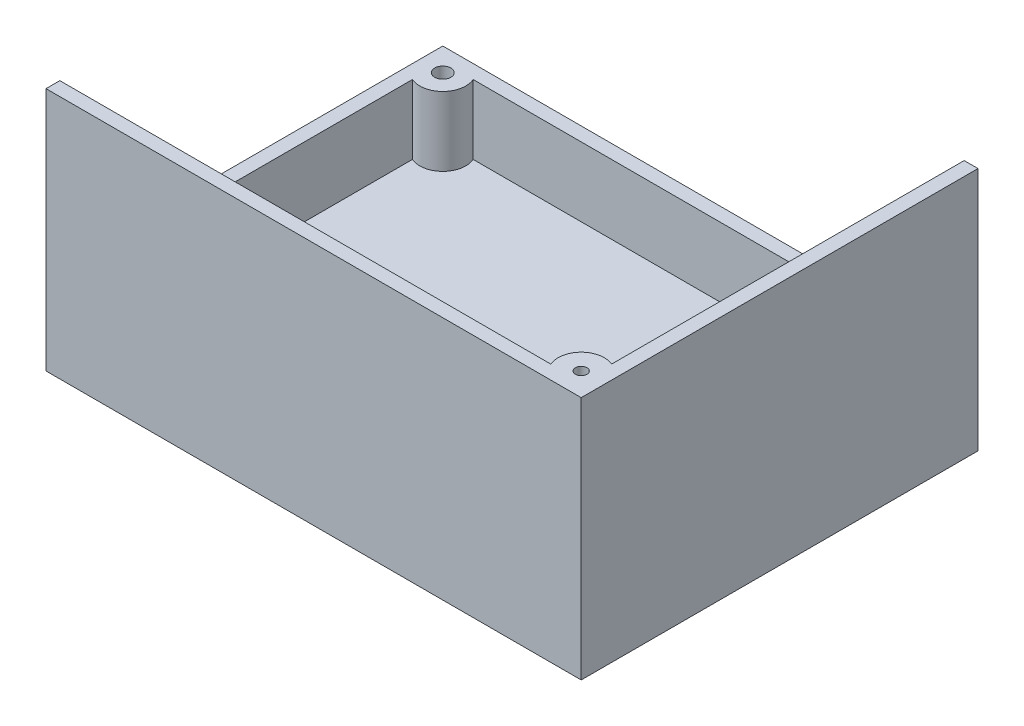
ISO-10303-21;
HEADER;
FILE_DESCRIPTION(('STEP AP214'),'2;1');
FILE_NAME('part.step','',(''),(''),'','','');
FILE_SCHEMA(('AUTOMOTIVE_DESIGN { 1 0 10303 214 1 1 1 1 }'));
ENDSEC;
DATA;
#1=APPLICATION_CONTEXT('core data for automotive mechanical design processes');
#2=APPLICATION_PROTOCOL_DEFINITION('international standard','automotive_design',2000,#1);
#3=PRODUCT_CONTEXT('',#1,'mechanical');
#4=PRODUCT('Part','Part','',(#3));
#5=PRODUCT_RELATED_PRODUCT_CATEGORY('part','',(#4));
#6=PRODUCT_DEFINITION_FORMATION('','',#4);
#7=PRODUCT_DEFINITION_CONTEXT('part definition',#1,'design');
#8=PRODUCT_DEFINITION('design','',#6,#7);
#9=PRODUCT_DEFINITION_SHAPE('','',#8);
#10=(LENGTH_UNIT() NAMED_UNIT(*) SI_UNIT(.MILLI.,.METRE.));
#11=(NAMED_UNIT(*) PLANE_ANGLE_UNIT() SI_UNIT($,.RADIAN.));
#12=(NAMED_UNIT(*) SI_UNIT($,.STERADIAN.) SOLID_ANGLE_UNIT());
#13=UNCERTAINTY_MEASURE_WITH_UNIT(LENGTH_MEASURE(1.E-05),#10,'distance_accuracy_value','');
#14=(GEOMETRIC_REPRESENTATION_CONTEXT(3) GLOBAL_UNCERTAINTY_ASSIGNED_CONTEXT((#13)) GLOBAL_UNIT_ASSIGNED_CONTEXT((#10,
#11,#12)) REPRESENTATION_CONTEXT('',''));
#15=CARTESIAN_POINT('',(0.,0.,0.));
#16=DIRECTION('',(0.,0.,1.));
#17=DIRECTION('',(1.,0.,0.));
#18=AXIS2_PLACEMENT_3D('',#15,#16,#17);
#19=CARTESIAN_POINT('',(0.,53.,0.));
#20=DIRECTION('',(0.,0.,-1.));
#21=DIRECTION('',(-1.,0.,0.));
#22=AXIS2_PLACEMENT_3D('',#19,#20,#21);
#23=PLANE('',#22);
#24=DIRECTION('',(0.,-1.,0.));
#25=VECTOR('',#24,1.);
#26=CARTESIAN_POINT('',(110.,38.,0.));
#27=LINE('',#26,#25);
#28=CARTESIAN_POINT('',(110.,38.,0.));
#29=VERTEX_POINT('',#28);
#30=CARTESIAN_POINT('',(110.,3.,0.));
#31=VERTEX_POINT('',#30);
#32=EDGE_CURVE('E162',#29,#31,#27,.T.);
#33=ORIENTED_EDGE('',*,*,#32,.T.);
#34=DIRECTION('',(1.,0.,0.));
#35=VECTOR('',#34,1.);
#36=CARTESIAN_POINT('',(0.,3.,0.));
#37=LINE('',#36,#35);
#38=CARTESIAN_POINT('',(0.,3.,0.));
#39=VERTEX_POINT('',#38);
#40=EDGE_CURVE('E329',#39,#31,#37,.T.);
#41=ORIENTED_EDGE('',*,*,#40,.F.);
#42=DIRECTION('',(0.,-1.,0.));
#43=VECTOR('',#42,1.);
#44=CARTESIAN_POINT('',(0.,53.,0.));
#45=LINE('',#44,#43);
#46=CARTESIAN_POINT('',(0.,18.,0.));
#47=VERTEX_POINT('',#46);
#48=EDGE_CURVE('E278',#47,#39,#45,.T.);
#49=ORIENTED_EDGE('',*,*,#48,.F.);
#50=DIRECTION('',(-1.,0.,0.));
#51=VECTOR('',#50,1.);
#52=CARTESIAN_POINT('',(110.,18.,0.));
#53=LINE('',#52,#51);
#54=CARTESIAN_POINT('',(-3.,18.,0.));
#55=VERTEX_POINT('',#54);
#56=EDGE_CURVE('E221',#47,#55,#53,.T.);
#57=ORIENTED_EDGE('',*,*,#56,.T.);
#58=DIRECTION('',(0.,1.,0.));
#59=VECTOR('',#58,1.);
#60=CARTESIAN_POINT('',(-3.,53.,0.));
#61=LINE('',#60,#59);
#62=CARTESIAN_POINT('',(-3.,53.,0.));
#63=VERTEX_POINT('',#62);
#64=EDGE_CURVE('E224',#55,#63,#61,.T.);
#65=ORIENTED_EDGE('',*,*,#64,.T.);
#66=DIRECTION('',(1.,0.,0.));
#67=VECTOR('',#66,1.);
#68=CARTESIAN_POINT('',(0.,53.,0.));
#69=LINE('',#68,#67);
#70=CARTESIAN_POINT('',(103.417424305044,53.,0.));
#71=VERTEX_POINT('',#70);
#72=EDGE_CURVE('E269',#63,#71,#69,.T.);
#73=ORIENTED_EDGE('',*,*,#72,.T.);
#74=DIRECTION('',(0.,-1.,0.));
#75=VECTOR('',#74,1.);
#76=CARTESIAN_POINT('',(103.417424305044,53.,0.));
#77=LINE('',#76,#75);
#78=CARTESIAN_POINT('',(103.417424305044,38.,0.));
#79=VERTEX_POINT('',#78);
#80=EDGE_CURVE('E164',#71,#79,#77,.T.);
#81=ORIENTED_EDGE('',*,*,#80,.T.);
#82=DIRECTION('',(1.,0.,0.));
#83=VECTOR('',#82,1.);
#84=CARTESIAN_POINT('',(110.,38.,0.));
#85=LINE('',#84,#83);
#86=EDGE_CURVE('E159',#79,#29,#85,.T.);
#87=ORIENTED_EDGE('',*,*,#86,.T.);
#88=EDGE_LOOP('',(#33,#41,#49,#57,#65,#73,#81,#87));
#89=FACE_BOUND('',#88,.T.);
#90=ADVANCED_FACE('F39',(#89),#23,.T.);
#91=CARTESIAN_POINT('',(110.,53.,0.));
#92=DIRECTION('',(-1.,0.,0.));
#93=DIRECTION('',(0.,0.,1.));
#94=AXIS2_PLACEMENT_3D('',#91,#92,#93);
#95=PLANE('',#94);
#96=DIRECTION('',(0.,-1.,0.));
#97=VECTOR('',#96,1.);
#98=CARTESIAN_POINT('',(110.,53.,-80.));
#99=LINE('',#98,#97);
#100=CARTESIAN_POINT('',(110.,18.,-80.));
#101=VERTEX_POINT('',#100);
#102=CARTESIAN_POINT('',(110.,3.,-80.));
#103=VERTEX_POINT('',#102);
#104=EDGE_CURVE('E275',#101,#103,#99,.T.);
#105=ORIENTED_EDGE('',*,*,#104,.T.);
#106=DIRECTION('',(0.,0.,-1.));
#107=VECTOR('',#106,1.);
#108=CARTESIAN_POINT('',(110.,3.,0.));
#109=LINE('',#108,#107);
#110=EDGE_CURVE('E174',#31,#103,#109,.T.);
#111=ORIENTED_EDGE('',*,*,#110,.F.);
#112=ORIENTED_EDGE('',*,*,#32,.F.);
#113=DIRECTION('',(0.,0.,-1.));
#114=VECTOR('',#113,1.);
#115=CARTESIAN_POINT('',(110.,38.,0.));
#116=LINE('',#115,#114);
#117=CARTESIAN_POINT('',(110.,38.,-6.58257569495584));
#118=VERTEX_POINT('',#117);
#119=EDGE_CURVE('E169',#29,#118,#116,.T.);
#120=ORIENTED_EDGE('',*,*,#119,.T.);
#121=DIRECTION('',(0.,-1.,0.));
#122=VECTOR('',#121,1.);
#123=CARTESIAN_POINT('',(110.,53.,-6.58257569495584));
#124=LINE('',#123,#122);
#125=CARTESIAN_POINT('',(110.,53.,-6.58257569495584));
#126=VERTEX_POINT('',#125);
#127=EDGE_CURVE('E11',#118,#126,#124,.F.);
#128=ORIENTED_EDGE('',*,*,#127,.T.);
#129=DIRECTION('',(0.,0.,-1.));
#130=VECTOR('',#129,1.);
#131=CARTESIAN_POINT('',(110.,53.,0.));
#132=LINE('',#131,#130);
#133=CARTESIAN_POINT('',(110.,53.,-83.));
#134=VERTEX_POINT('',#133);
#135=EDGE_CURVE('E272',#126,#134,#132,.T.);
#136=ORIENTED_EDGE('',*,*,#135,.T.);
#137=DIRECTION('',(0.,-1.,0.));
#138=VECTOR('',#137,1.);
#139=CARTESIAN_POINT('',(110.,53.,-83.));
#140=LINE('',#139,#138);
#141=CARTESIAN_POINT('',(110.,18.,-83.));
#142=VERTEX_POINT('',#141);
#143=EDGE_CURVE('E220',#134,#142,#140,.T.);
#144=ORIENTED_EDGE('',*,*,#143,.T.);
#145=DIRECTION('',(0.,0.,-1.));
#146=VECTOR('',#145,1.);
#147=CARTESIAN_POINT('',(110.,18.,0.));
#148=LINE('',#147,#146);
#149=EDGE_CURVE('E229',#101,#142,#148,.T.);
#150=ORIENTED_EDGE('',*,*,#149,.F.);
#151=EDGE_LOOP('',(#105,#111,#112,#120,#128,#136,#144,#150));
#152=FACE_BOUND('',#151,.T.);
#153=ADVANCED_FACE('F173',(#152),#95,.T.);
#154=CARTESIAN_POINT('',(2.,-6.99999999999996,-78.));
#155=DIRECTION('',(0.,1.,0.));
#156=DIRECTION('',(0.,0.,1.));
#157=AXIS2_PLACEMENT_3D('',#154,#155,#156);
#158=CYLINDRICAL_SURFACE('',#157,1.75);
#159=CARTESIAN_POINT('',(2.,18.,-78.));
#160=DIRECTION('',(0.,1.,0.));
#161=DIRECTION('',(0.,0.,1.));
#162=AXIS2_PLACEMENT_3D('',#159,#160,#161);
#163=CIRCLE('',#162,1.75);
#164=CARTESIAN_POINT('',(2.,18.,-76.25));
#165=VERTEX_POINT('',#164);
#166=EDGE_CURVE('E203',#165,#165,#163,.T.);
#167=ORIENTED_EDGE('',*,*,#166,.T.);
#168=EDGE_LOOP('',(#167));
#169=FACE_BOUND('',#168,.T.);
#170=CARTESIAN_POINT('',(2.,9.99999999999995,-78.));
#171=DIRECTION('',(0.,-1.,0.));
#172=DIRECTION('',(0.,0.,-1.));
#173=AXIS2_PLACEMENT_3D('',#170,#171,#172);
#174=CIRCLE('',#173,1.75);
#175=CARTESIAN_POINT('',(2.,9.99999999999995,-79.75));
#176=VERTEX_POINT('',#175);
#177=EDGE_CURVE('E199',#176,#176,#174,.F.);
#178=ORIENTED_EDGE('',*,*,#177,.F.);
#179=EDGE_LOOP('',(#178));
#180=FACE_BOUND('',#179,.T.);
#181=ADVANCED_FACE('F355',(#169,#180),#158,.F.);
#182=CARTESIAN_POINT('',(0.,53.,0.));
#183=DIRECTION('',(1.,0.,0.));
#184=DIRECTION('',(0.,0.,-1.));
#185=AXIS2_PLACEMENT_3D('',#182,#183,#184);
#186=PLANE('',#185);
#187=DIRECTION('',(0.,0.,-1.));
#188=VECTOR('',#187,1.);
#189=CARTESIAN_POINT('',(0.,3.,0.));
#190=LINE('',#189,#188);
#191=CARTESIAN_POINT('',(0.,3.,-73.4174243050442));
#192=VERTEX_POINT('',#191);
#193=EDGE_CURVE('E332',#39,#192,#190,.T.);
#194=ORIENTED_EDGE('',*,*,#193,.T.);
#195=DIRECTION('',(0.,-1.,0.));
#196=VECTOR('',#195,1.);
#197=CARTESIAN_POINT('',(0.,18.,-73.4174243050442));
#198=LINE('',#197,#196);
#199=CARTESIAN_POINT('',(0.,18.,-73.4174243050442));
#200=VERTEX_POINT('',#199);
#201=EDGE_CURVE('E216',#192,#200,#198,.F.);
#202=ORIENTED_EDGE('',*,*,#201,.T.);
#203=DIRECTION('',(0.,0.,-1.));
#204=VECTOR('',#203,1.);
#205=CARTESIAN_POINT('',(0.,18.,0.));
#206=LINE('',#205,#204);
#207=CARTESIAN_POINT('',(0.,18.,-11.5));
#208=VERTEX_POINT('',#207);
#209=EDGE_CURVE('E247',#208,#200,#206,.T.);
#210=ORIENTED_EDGE('',*,*,#209,.F.);
#211=CARTESIAN_POINT('',(0.,18.,-7.));
#212=DIRECTION('',(1.,0.,0.));
#213=DIRECTION('',(0.,0.,-1.));
#214=AXIS2_PLACEMENT_3D('',#211,#212,#213);
#215=CIRCLE('',#214,4.5);
#216=CARTESIAN_POINT('',(0.,18.,-2.5));
#217=VERTEX_POINT('',#216);
#218=EDGE_CURVE('E268',#217,#208,#215,.T.);
#219=ORIENTED_EDGE('',*,*,#218,.F.);
#220=EDGE_CURVE('E251',#47,#217,#206,.T.);
#221=ORIENTED_EDGE('',*,*,#220,.F.);
#222=ORIENTED_EDGE('',*,*,#48,.T.);
#223=EDGE_LOOP('',(#194,#202,#210,#219,#221,#222));
#224=FACE_BOUND('',#223,.T.);
#225=ADVANCED_FACE('F357',(#224),#186,.T.);
#226=CARTESIAN_POINT('',(0.,53.,-80.));
#227=DIRECTION('',(0.,0.,1.));
#228=DIRECTION('',(1.,0.,0.));
#229=AXIS2_PLACEMENT_3D('',#226,#227,#228);
#230=PLANE('',#229);
#231=DIRECTION('',(1.,0.,0.));
#232=VECTOR('',#231,1.);
#233=CARTESIAN_POINT('',(0.,18.,-80.));
#234=LINE('',#233,#232);
#235=CARTESIAN_POINT('',(6.58257569495584,18.,-80.));
#236=VERTEX_POINT('',#235);
#237=CARTESIAN_POINT('',(87.5,18.,-80.));
#238=VERTEX_POINT('',#237);
#239=EDGE_CURVE('E246',#236,#238,#234,.T.);
#240=ORIENTED_EDGE('',*,*,#239,.F.);
#241=DIRECTION('',(0.,-1.,0.));
#242=VECTOR('',#241,1.);
#243=CARTESIAN_POINT('',(6.58257569495584,18.,-80.));
#244=LINE('',#243,#242);
#245=CARTESIAN_POINT('',(6.58257569495584,3.,-80.));
#246=VERTEX_POINT('',#245);
#247=EDGE_CURVE('E210',#236,#246,#244,.T.);
#248=ORIENTED_EDGE('',*,*,#247,.T.);
#249=DIRECTION('',(1.,0.,0.));
#250=VECTOR('',#249,1.);
#251=CARTESIAN_POINT('',(0.,3.,-80.));
#252=LINE('',#251,#250);
#253=EDGE_CURVE('E323',#246,#103,#252,.T.);
#254=ORIENTED_EDGE('',*,*,#253,.T.);
#255=ORIENTED_EDGE('',*,*,#104,.F.);
#256=CARTESIAN_POINT('',(98.5,18.,-80.));
#257=VERTEX_POINT('',#256);
#258=EDGE_CURVE('E240',#257,#101,#234,.T.);
#259=ORIENTED_EDGE('',*,*,#258,.F.);
#260=CARTESIAN_POINT('',(93.,18.,-80.));
#261=DIRECTION('',(0.,0.,1.));
#262=DIRECTION('',(1.,0.,0.));
#263=AXIS2_PLACEMENT_3D('',#260,#261,#262);
#264=CIRCLE('',#263,5.5);
#265=EDGE_CURVE('E263',#238,#257,#264,.T.);
#266=ORIENTED_EDGE('',*,*,#265,.F.);
#267=EDGE_LOOP('',(#240,#248,#254,#255,#259,#266));
#268=FACE_BOUND('',#267,.T.);
#269=ADVANCED_FACE('F364',(#268),#230,.T.);
#270=CARTESIAN_POINT('',(0.,3.,0.));
#271=DIRECTION('',(0.,1.,0.));
#272=DIRECTION('',(0.,0.,1.));
#273=AXIS2_PLACEMENT_3D('',#270,#271,#272);
#274=PLANE('',#273);
#275=ORIENTED_EDGE('',*,*,#110,.T.);
#276=ORIENTED_EDGE('',*,*,#253,.F.);
#277=CARTESIAN_POINT('',(2.,3.,-78.));
#278=DIRECTION('',(0.,1.,0.));
#279=DIRECTION('',(0.,0.,1.));
#280=AXIS2_PLACEMENT_3D('',#277,#278,#279);
#281=CIRCLE('',#280,5.);
#282=EDGE_CURVE('E207',#192,#246,#281,.T.);
#283=ORIENTED_EDGE('',*,*,#282,.F.);
#284=ORIENTED_EDGE('',*,*,#193,.F.);
#285=ORIENTED_EDGE('',*,*,#40,.T.);
#286=EDGE_LOOP('',(#275,#276,#283,#284,#285));
#287=FACE_BOUND('',#286,.T.);
#288=ADVANCED_FACE('F380',(#287),#274,.T.);
#289=CARTESIAN_POINT('',(0.,53.,0.));
#290=DIRECTION('',(0.,-1.,0.));
#291=DIRECTION('',(0.,0.,-1.));
#292=AXIS2_PLACEMENT_3D('',#289,#290,#291);
#293=PLANE('',#292);
#294=ORIENTED_EDGE('',*,*,#135,.F.);
#295=CARTESIAN_POINT('',(108.,53.,-2.));
#296=DIRECTION('',(0.,1.,0.));
#297=DIRECTION('',(0.,0.,1.));
#298=AXIS2_PLACEMENT_3D('',#295,#296,#297);
#299=CIRCLE('',#298,5.);
#300=EDGE_CURVE('E188',#126,#71,#299,.T.);
#301=ORIENTED_EDGE('',*,*,#300,.T.);
#302=ORIENTED_EDGE('',*,*,#72,.F.);
#303=DIRECTION('',(0.,0.,1.));
#304=VECTOR('',#303,1.);
#305=CARTESIAN_POINT('',(-3.,53.,3.));
#306=LINE('',#305,#304);
#307=CARTESIAN_POINT('',(-3.,53.,3.));
#308=VERTEX_POINT('',#307);
#309=EDGE_CURVE('E282',#63,#308,#306,.T.);
#310=ORIENTED_EDGE('',*,*,#309,.T.);
#311=DIRECTION('',(1.,0.,0.));
#312=VECTOR('',#311,1.);
#313=CARTESIAN_POINT('',(-3.,53.,3.));
#314=LINE('',#313,#312);
#315=CARTESIAN_POINT('',(113.,53.,3.));
#316=VERTEX_POINT('',#315);
#317=EDGE_CURVE('E285',#308,#316,#314,.T.);
#318=ORIENTED_EDGE('',*,*,#317,.T.);
#319=DIRECTION('',(0.,0.,-1.));
#320=VECTOR('',#319,1.);
#321=CARTESIAN_POINT('',(113.,53.,3.));
#322=LINE('',#321,#320);
#323=CARTESIAN_POINT('',(113.,53.,-83.));
#324=VERTEX_POINT('',#323);
#325=EDGE_CURVE('E289',#316,#324,#322,.T.);
#326=ORIENTED_EDGE('',*,*,#325,.T.);
#327=DIRECTION('',(-1.,0.,0.));
#328=VECTOR('',#327,1.);
#329=CARTESIAN_POINT('',(-3.,53.,-83.));
#330=LINE('',#329,#328);
#331=EDGE_CURVE('E292',#324,#134,#330,.T.);
#332=ORIENTED_EDGE('',*,*,#331,.T.);
#333=EDGE_LOOP('',(#294,#301,#302,#310,#318,#326,#332));
#334=FACE_BOUND('',#333,.T.);
#335=CARTESIAN_POINT('',(108.,53.,-2.));
#336=DIRECTION('',(0.,1.,0.));
#337=DIRECTION('',(0.,0.,1.));
#338=AXIS2_PLACEMENT_3D('',#335,#336,#337);
#339=CIRCLE('',#338,1.25);
#340=CARTESIAN_POINT('',(108.,53.,-0.750000000000002));
#341=VERTEX_POINT('',#340);
#342=EDGE_CURVE('E184',#341,#341,#339,.T.);
#343=ORIENTED_EDGE('',*,*,#342,.F.);
#344=EDGE_LOOP('',(#343));
#345=FACE_BOUND('',#344,.T.);
#346=ADVANCED_FACE('F376',(#334,#345),#293,.F.);
#347=CARTESIAN_POINT('',(-3.,53.,3.));
#348=DIRECTION('',(1.,0.,0.));
#349=DIRECTION('',(0.,0.,-1.));
#350=AXIS2_PLACEMENT_3D('',#347,#348,#349);
#351=PLANE('',#350);
#352=DIRECTION('',(0.,0.,-1.));
#353=VECTOR('',#352,1.);
#354=CARTESIAN_POINT('',(-3.,18.,0.));
#355=LINE('',#354,#353);
#356=CARTESIAN_POINT('',(-3.,18.,-11.5));
#357=VERTEX_POINT('',#356);
#358=CARTESIAN_POINT('',(-3.,18.,-83.));
#359=VERTEX_POINT('',#358);
#360=EDGE_CURVE('E241',#357,#359,#355,.T.);
#361=ORIENTED_EDGE('',*,*,#360,.T.);
#362=DIRECTION('',(0.,-1.,0.));
#363=VECTOR('',#362,1.);
#364=CARTESIAN_POINT('',(-3.,53.,-83.));
#365=LINE('',#364,#363);
#366=CARTESIAN_POINT('',(-3.,0.,-83.));
#367=VERTEX_POINT('',#366);
#368=EDGE_CURVE('E296',#359,#367,#365,.T.);
#369=ORIENTED_EDGE('',*,*,#368,.T.);
#370=DIRECTION('',(0.,0.,1.));
#371=VECTOR('',#370,1.);
#372=CARTESIAN_POINT('',(-3.,0.,3.));
#373=LINE('',#372,#371);
#374=CARTESIAN_POINT('',(-3.,0.,3.));
#375=VERTEX_POINT('',#374);
#376=EDGE_CURVE('E281',#367,#375,#373,.T.);
#377=ORIENTED_EDGE('',*,*,#376,.T.);
#378=DIRECTION('',(0.,-1.,0.));
#379=VECTOR('',#378,1.);
#380=CARTESIAN_POINT('',(-3.,53.,3.));
#381=LINE('',#380,#379);
#382=EDGE_CURVE('E319',#308,#375,#381,.T.);
#383=ORIENTED_EDGE('',*,*,#382,.F.);
#384=ORIENTED_EDGE('',*,*,#309,.F.);
#385=ORIENTED_EDGE('',*,*,#64,.F.);
#386=CARTESIAN_POINT('',(-3.,18.,-2.5));
#387=VERTEX_POINT('',#386);
#388=EDGE_CURVE('E236',#55,#387,#355,.T.);
#389=ORIENTED_EDGE('',*,*,#388,.T.);
#390=CARTESIAN_POINT('',(-3.,18.,-7.));
#391=DIRECTION('',(-1.,0.,0.));
#392=DIRECTION('',(0.,0.,1.));
#393=AXIS2_PLACEMENT_3D('',#390,#391,#392);
#394=CIRCLE('',#393,4.5);
#395=EDGE_CURVE('E264',#357,#387,#394,.T.);
#396=ORIENTED_EDGE('',*,*,#395,.F.);
#397=EDGE_LOOP('',(#361,#369,#377,#383,#384,#385,#389,#396));
#398=FACE_BOUND('',#397,.T.);
#399=ADVANCED_FACE('F379',(#398),#351,.F.);
#400=CARTESIAN_POINT('',(-3.,53.,3.));
#401=DIRECTION('',(0.,0.,-1.));
#402=DIRECTION('',(-1.,0.,0.));
#403=AXIS2_PLACEMENT_3D('',#400,#401,#402);
#404=PLANE('',#403);
#405=DIRECTION('',(0.,-1.,0.));
#406=VECTOR('',#405,1.);
#407=CARTESIAN_POINT('',(113.,53.,3.));
#408=LINE('',#407,#406);
#409=CARTESIAN_POINT('',(113.,0.,3.));
#410=VERTEX_POINT('',#409);
#411=EDGE_CURVE('E315',#316,#410,#408,.T.);
#412=ORIENTED_EDGE('',*,*,#411,.F.);
#413=ORIENTED_EDGE('',*,*,#317,.F.);
#414=ORIENTED_EDGE('',*,*,#382,.T.);
#415=DIRECTION('',(1.,0.,0.));
#416=VECTOR('',#415,1.);
#417=CARTESIAN_POINT('',(-3.,0.,3.));
#418=LINE('',#417,#416);
#419=EDGE_CURVE('E300',#375,#410,#418,.T.);
#420=ORIENTED_EDGE('',*,*,#419,.T.);
#421=EDGE_LOOP('',(#412,#413,#414,#420));
#422=FACE_BOUND('',#421,.T.);
#423=ADVANCED_FACE('F389',(#422),#404,.F.);
#424=CARTESIAN_POINT('',(113.,53.,3.));
#425=DIRECTION('',(-1.,0.,0.));
#426=DIRECTION('',(0.,0.,1.));
#427=AXIS2_PLACEMENT_3D('',#424,#425,#426);
#428=PLANE('',#427);
#429=DIRECTION('',(0.,-1.,0.));
#430=VECTOR('',#429,1.);
#431=CARTESIAN_POINT('',(113.,53.,-83.));
#432=LINE('',#431,#430);
#433=CARTESIAN_POINT('',(113.,0.,-83.));
#434=VERTEX_POINT('',#433);
#435=EDGE_CURVE('E311',#324,#434,#432,.T.);
#436=ORIENTED_EDGE('',*,*,#435,.F.);
#437=ORIENTED_EDGE('',*,*,#325,.F.);
#438=ORIENTED_EDGE('',*,*,#411,.T.);
#439=DIRECTION('',(0.,0.,-1.));
#440=VECTOR('',#439,1.);
#441=CARTESIAN_POINT('',(113.,0.,3.));
#442=LINE('',#441,#440);
#443=EDGE_CURVE('E303',#410,#434,#442,.T.);
#444=ORIENTED_EDGE('',*,*,#443,.T.);
#445=EDGE_LOOP('',(#436,#437,#438,#444));
#446=FACE_BOUND('',#445,.T.);
#447=ADVANCED_FACE('F385',(#446),#428,.F.);
#448=CARTESIAN_POINT('',(-3.,53.,-83.));
#449=DIRECTION('',(0.,0.,1.));
#450=DIRECTION('',(1.,0.,0.));
#451=AXIS2_PLACEMENT_3D('',#448,#449,#450);
#452=PLANE('',#451);
#453=ORIENTED_EDGE('',*,*,#368,.F.);
#454=DIRECTION('',(-1.,0.,0.));
#455=VECTOR('',#454,1.);
#456=CARTESIAN_POINT('',(110.,18.,-83.));
#457=LINE('',#456,#455);
#458=CARTESIAN_POINT('',(87.5,18.,-83.));
#459=VERTEX_POINT('',#458);
#460=EDGE_CURVE('E233',#459,#359,#457,.T.);
#461=ORIENTED_EDGE('',*,*,#460,.F.);
#462=CARTESIAN_POINT('',(93.,18.,-83.));
#463=DIRECTION('',(0.,0.,-1.));
#464=DIRECTION('',(-1.,0.,0.));
#465=AXIS2_PLACEMENT_3D('',#462,#463,#464);
#466=CIRCLE('',#465,5.5);
#467=CARTESIAN_POINT('',(98.5,18.,-83.));
#468=VERTEX_POINT('',#467);
#469=EDGE_CURVE('E259',#468,#459,#466,.T.);
#470=ORIENTED_EDGE('',*,*,#469,.F.);
#471=EDGE_CURVE('E225',#142,#468,#457,.T.);
#472=ORIENTED_EDGE('',*,*,#471,.F.);
#473=ORIENTED_EDGE('',*,*,#143,.F.);
#474=ORIENTED_EDGE('',*,*,#331,.F.);
#475=ORIENTED_EDGE('',*,*,#435,.T.);
#476=DIRECTION('',(-1.,0.,0.));
#477=VECTOR('',#476,1.);
#478=CARTESIAN_POINT('',(-3.,0.,-83.));
#479=LINE('',#478,#477);
#480=EDGE_CURVE('E286',#434,#367,#479,.T.);
#481=ORIENTED_EDGE('',*,*,#480,.T.);
#482=EDGE_LOOP('',(#453,#461,#470,#472,#473,#474,#475,#481));
#483=FACE_BOUND('',#482,.T.);
#484=ADVANCED_FACE('F382',(#483),#452,.F.);
#485=CARTESIAN_POINT('',(0.,0.,0.));
#486=DIRECTION('',(0.,1.,0.));
#487=DIRECTION('',(0.,0.,1.));
#488=AXIS2_PLACEMENT_3D('',#485,#486,#487);
#489=PLANE('',#488);
#490=CARTESIAN_POINT('',(2.,0.,-78.));
#491=DIRECTION('',(0.,-1.,0.));
#492=DIRECTION('',(0.,0.,-1.));
#493=AXIS2_PLACEMENT_3D('',#490,#491,#492);
#494=CIRCLE('',#493,3.);
#495=CARTESIAN_POINT('',(2.,0.,-81.));
#496=VERTEX_POINT('',#495);
#497=EDGE_CURVE('E194',#496,#496,#494,.T.);
#498=ORIENTED_EDGE('',*,*,#497,.F.);
#499=EDGE_LOOP('',(#498));
#500=FACE_BOUND('',#499,.T.);
#501=ORIENTED_EDGE('',*,*,#376,.F.);
#502=ORIENTED_EDGE('',*,*,#480,.F.);
#503=ORIENTED_EDGE('',*,*,#443,.F.);
#504=ORIENTED_EDGE('',*,*,#419,.F.);
#505=EDGE_LOOP('',(#501,#502,#503,#504));
#506=FACE_BOUND('',#505,.T.);
#507=ADVANCED_FACE('F41',(#500,#506),#489,.F.);
#508=CARTESIAN_POINT('',(50.,18.,-7.));
#509=DIRECTION('',(-1.,0.,0.));
#510=DIRECTION('',(0.,0.,1.));
#511=AXIS2_PLACEMENT_3D('',#508,#509,#510);
#512=CYLINDRICAL_SURFACE('',#511,4.5);
#513=ORIENTED_EDGE('',*,*,#395,.T.);
#514=DIRECTION('',(-1.,0.,0.));
#515=VECTOR('',#514,1.);
#516=CARTESIAN_POINT('',(50.,18.,-2.5));
#517=LINE('',#516,#515);
#518=EDGE_CURVE('E255',#387,#217,#517,.F.);
#519=ORIENTED_EDGE('',*,*,#518,.T.);
#520=ORIENTED_EDGE('',*,*,#218,.T.);
#521=DIRECTION('',(-1.,0.,0.));
#522=VECTOR('',#521,1.);
#523=CARTESIAN_POINT('',(50.,18.,-11.5));
#524=LINE('',#523,#522);
#525=EDGE_CURVE('E250',#208,#357,#524,.T.);
#526=ORIENTED_EDGE('',*,*,#525,.T.);
#527=EDGE_LOOP('',(#513,#519,#520,#526));
#528=FACE_BOUND('',#527,.T.);
#529=ADVANCED_FACE('F432',(#528),#512,.F.);
#530=CARTESIAN_POINT('',(93.,18.,-30.));
#531=DIRECTION('',(0.,0.,-1.));
#532=DIRECTION('',(-1.,0.,0.));
#533=AXIS2_PLACEMENT_3D('',#530,#531,#532);
#534=CYLINDRICAL_SURFACE('',#533,5.5);
#535=ORIENTED_EDGE('',*,*,#469,.T.);
#536=DIRECTION('',(0.,0.,-1.));
#537=VECTOR('',#536,1.);
#538=CARTESIAN_POINT('',(87.5,18.,-30.));
#539=LINE('',#538,#537);
#540=EDGE_CURVE('E49',#459,#238,#539,.F.);
#541=ORIENTED_EDGE('',*,*,#540,.T.);
#542=ORIENTED_EDGE('',*,*,#265,.T.);
#543=DIRECTION('',(0.,0.,-1.));
#544=VECTOR('',#543,1.);
#545=CARTESIAN_POINT('',(98.5,18.,-30.));
#546=LINE('',#545,#544);
#547=EDGE_CURVE('E336',#257,#468,#546,.T.);
#548=ORIENTED_EDGE('',*,*,#547,.T.);
#549=EDGE_LOOP('',(#535,#541,#542,#548));
#550=FACE_BOUND('',#549,.T.);
#551=ADVANCED_FACE('F415',(#550),#534,.F.);
#552=CARTESIAN_POINT('',(110.,18.,0.));
#553=DIRECTION('',(0.,-1.,0.));
#554=DIRECTION('',(0.,0.,-1.));
#555=AXIS2_PLACEMENT_3D('',#552,#553,#554);
#556=PLANE('',#555);
#557=ORIENTED_EDGE('',*,*,#258,.T.);
#558=ORIENTED_EDGE('',*,*,#149,.T.);
#559=ORIENTED_EDGE('',*,*,#471,.T.);
#560=ORIENTED_EDGE('',*,*,#547,.F.);
#561=EDGE_LOOP('',(#557,#558,#559,#560));
#562=FACE_BOUND('',#561,.T.);
#563=ADVANCED_FACE('F412',(#562),#556,.F.);
#564=ORIENTED_EDGE('',*,*,#166,.F.);
#565=EDGE_LOOP('',(#564));
#566=FACE_BOUND('',#565,.T.);
#567=ORIENTED_EDGE('',*,*,#460,.T.);
#568=ORIENTED_EDGE('',*,*,#360,.F.);
#569=ORIENTED_EDGE('',*,*,#525,.F.);
#570=ORIENTED_EDGE('',*,*,#209,.T.);
#571=CARTESIAN_POINT('',(2.,18.,-78.));
#572=DIRECTION('',(0.,1.,0.));
#573=DIRECTION('',(0.,0.,1.));
#574=AXIS2_PLACEMENT_3D('',#571,#572,#573);
#575=CIRCLE('',#574,5.);
#576=EDGE_CURVE('E62',#200,#236,#575,.T.);
#577=ORIENTED_EDGE('',*,*,#576,.T.);
#578=ORIENTED_EDGE('',*,*,#239,.T.);
#579=ORIENTED_EDGE('',*,*,#540,.F.);
#580=EDGE_LOOP('',(#567,#568,#569,#570,#577,#578,#579));
#581=FACE_BOUND('',#580,.T.);
#582=ADVANCED_FACE('F419',(#566,#581),#556,.F.);
#583=ORIENTED_EDGE('',*,*,#220,.T.);
#584=ORIENTED_EDGE('',*,*,#518,.F.);
#585=ORIENTED_EDGE('',*,*,#388,.F.);
#586=ORIENTED_EDGE('',*,*,#56,.F.);
#587=EDGE_LOOP('',(#583,#584,#585,#586));
#588=FACE_BOUND('',#587,.T.);
#589=ADVANCED_FACE('F427',(#588),#556,.F.);
#590=CARTESIAN_POINT('',(2.,18.,-78.));
#591=DIRECTION('',(0.,-1.,0.));
#592=DIRECTION('',(0.,0.,-1.));
#593=AXIS2_PLACEMENT_3D('',#590,#591,#592);
#594=CYLINDRICAL_SURFACE('',#593,5.);
#595=ORIENTED_EDGE('',*,*,#201,.F.);
#596=ORIENTED_EDGE('',*,*,#282,.T.);
#597=ORIENTED_EDGE('',*,*,#247,.F.);
#598=ORIENTED_EDGE('',*,*,#576,.F.);
#599=EDGE_LOOP('',(#595,#596,#597,#598));
#600=FACE_BOUND('',#599,.T.);
#601=ADVANCED_FACE('F439',(#600),#594,.T.);
#602=CARTESIAN_POINT('',(2.,9.99999999999995,-78.));
#603=DIRECTION('',(0.,-1.,0.));
#604=DIRECTION('',(0.,0.,-1.));
#605=AXIS2_PLACEMENT_3D('',#602,#603,#604);
#606=PLANE('',#605);
#607=CARTESIAN_POINT('',(2.,9.99999999999995,-78.));
#608=DIRECTION('',(0.,-1.,0.));
#609=DIRECTION('',(0.,0.,-1.));
#610=AXIS2_PLACEMENT_3D('',#607,#608,#609);
#611=CIRCLE('',#610,3.);
#612=CARTESIAN_POINT('',(2.,9.99999999999995,-81.));
#613=VERTEX_POINT('',#612);
#614=EDGE_CURVE('E195',#613,#613,#611,.T.);
#615=ORIENTED_EDGE('',*,*,#614,.T.);
#616=EDGE_LOOP('',(#615));
#617=FACE_BOUND('',#616,.T.);
#618=ORIENTED_EDGE('',*,*,#177,.T.);
#619=EDGE_LOOP('',(#618));
#620=FACE_BOUND('',#619,.T.);
#621=ADVANCED_FACE('F353',(#617,#620),#606,.T.);
#622=CARTESIAN_POINT('',(2.,9.99999999999995,-78.));
#623=DIRECTION('',(0.,-1.,0.));
#624=DIRECTION('',(0.,0.,-1.));
#625=AXIS2_PLACEMENT_3D('',#622,#623,#624);
#626=CYLINDRICAL_SURFACE('',#625,3.);
#627=ORIENTED_EDGE('',*,*,#614,.F.);
#628=EDGE_LOOP('',(#627));
#629=FACE_BOUND('',#628,.T.);
#630=ORIENTED_EDGE('',*,*,#497,.T.);
#631=EDGE_LOOP('',(#630));
#632=FACE_BOUND('',#631,.T.);
#633=ADVANCED_FACE('F445',(#629,#632),#626,.F.);
#634=CARTESIAN_POINT('',(108.,53.,-2.));
#635=DIRECTION('',(0.,-1.,0.));
#636=DIRECTION('',(0.,0.,-1.));
#637=AXIS2_PLACEMENT_3D('',#634,#635,#636);
#638=CYLINDRICAL_SURFACE('',#637,5.);
#639=ORIENTED_EDGE('',*,*,#127,.F.);
#640=CARTESIAN_POINT('',(108.,38.,-2.));
#641=DIRECTION('',(0.,1.,0.));
#642=DIRECTION('',(0.,0.,1.));
#643=AXIS2_PLACEMENT_3D('',#640,#641,#642);
#644=CIRCLE('',#643,5.);
#645=EDGE_CURVE('E178',#118,#79,#644,.T.);
#646=ORIENTED_EDGE('',*,*,#645,.T.);
#647=ORIENTED_EDGE('',*,*,#80,.F.);
#648=ORIENTED_EDGE('',*,*,#300,.F.);
#649=EDGE_LOOP('',(#639,#646,#647,#648));
#650=FACE_BOUND('',#649,.T.);
#651=ADVANCED_FACE('F473',(#650),#638,.T.);
#652=CARTESIAN_POINT('',(108.,53.,-2.));
#653=DIRECTION('',(0.,-1.,0.));
#654=DIRECTION('',(0.,0.,-1.));
#655=AXIS2_PLACEMENT_3D('',#652,#653,#654);
#656=CYLINDRICAL_SURFACE('',#655,1.25);
#657=CARTESIAN_POINT('',(108.,38.,-2.));
#658=DIRECTION('',(0.,1.,0.));
#659=DIRECTION('',(0.,0.,1.));
#660=AXIS2_PLACEMENT_3D('',#657,#658,#659);
#661=CIRCLE('',#660,1.25);
#662=CARTESIAN_POINT('',(108.,38.,-0.750000000000002));
#663=VERTEX_POINT('',#662);
#664=EDGE_CURVE('E43',#663,#663,#661,.T.);
#665=ORIENTED_EDGE('',*,*,#664,.F.);
#666=EDGE_LOOP('',(#665));
#667=FACE_BOUND('',#666,.T.);
#668=ORIENTED_EDGE('',*,*,#342,.T.);
#669=EDGE_LOOP('',(#668));
#670=FACE_BOUND('',#669,.T.);
#671=ADVANCED_FACE('F475',(#667,#670),#656,.F.);
#672=CARTESIAN_POINT('',(0.,38.,0.));
#673=DIRECTION('',(0.,1.,0.));
#674=DIRECTION('',(0.,0.,1.));
#675=AXIS2_PLACEMENT_3D('',#672,#673,#674);
#676=PLANE('',#675);
#677=ORIENTED_EDGE('',*,*,#664,.T.);
#678=EDGE_LOOP('',(#677));
#679=FACE_BOUND('',#678,.T.);
#680=ORIENTED_EDGE('',*,*,#119,.F.);
#681=ORIENTED_EDGE('',*,*,#86,.F.);
#682=ORIENTED_EDGE('',*,*,#645,.F.);
#683=EDGE_LOOP('',(#680,#681,#682));
#684=FACE_BOUND('',#683,.T.);
#685=ADVANCED_FACE('F177',(#679,#684),#676,.F.);
#686=CLOSED_SHELL('',(#90,#153,#181,#225,#269,#288,#346,#399,#423,#447,#484,#507,#529,#551,#563,
#582,#589,#601,#621,#633,#651,#671,#685));
#687=MANIFOLD_SOLID_BREP('B2',#686);
#688=ADVANCED_BREP_SHAPE_REPRESENTATION('',(#18,#687),#14);
#689=SHAPE_DEFINITION_REPRESENTATION(#9,#688);
ENDSEC;
END-ISO-10303-21;
